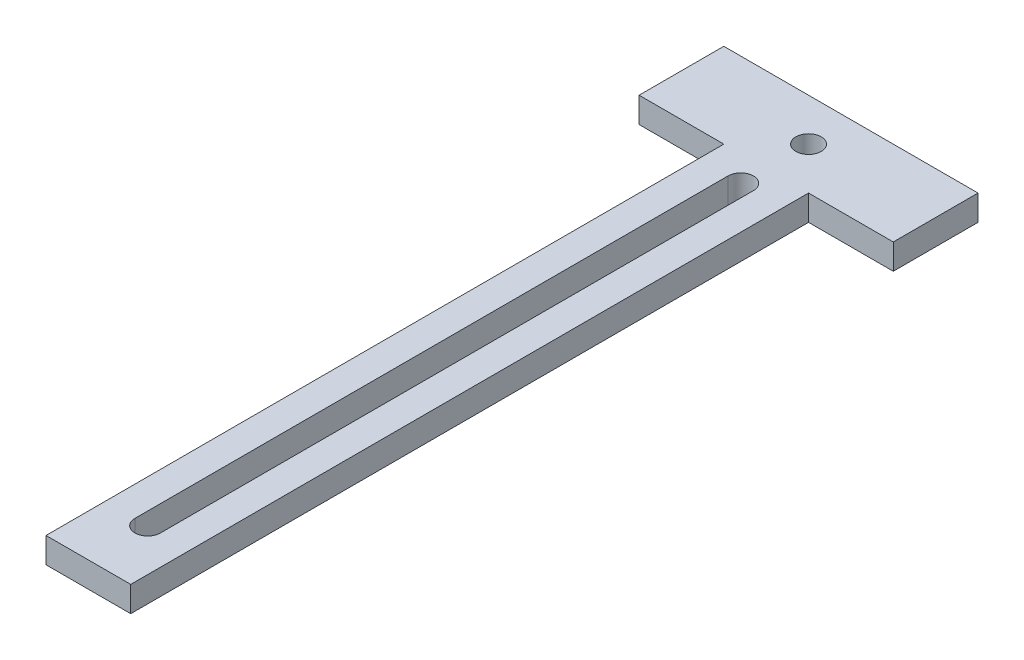
ISO-10303-21;
HEADER;
FILE_DESCRIPTION(('STEP AP214'),'2;1');
FILE_NAME('part.step','',(''),(''),'','','');
FILE_SCHEMA(('AUTOMOTIVE_DESIGN { 1 0 10303 214 1 1 1 1 }'));
ENDSEC;
DATA;
#1=APPLICATION_CONTEXT('core data for automotive mechanical design processes');
#2=APPLICATION_PROTOCOL_DEFINITION('international standard','automotive_design',2000,#1);
#3=PRODUCT_CONTEXT('',#1,'mechanical');
#4=PRODUCT('Part','Part','',(#3));
#5=PRODUCT_RELATED_PRODUCT_CATEGORY('part','',(#4));
#6=PRODUCT_DEFINITION_FORMATION('','',#4);
#7=PRODUCT_DEFINITION_CONTEXT('part definition',#1,'design');
#8=PRODUCT_DEFINITION('design','',#6,#7);
#9=PRODUCT_DEFINITION_SHAPE('','',#8);
#10=(LENGTH_UNIT() NAMED_UNIT(*) SI_UNIT(.MILLI.,.METRE.));
#11=(NAMED_UNIT(*) PLANE_ANGLE_UNIT() SI_UNIT($,.RADIAN.));
#12=(NAMED_UNIT(*) SI_UNIT($,.STERADIAN.) SOLID_ANGLE_UNIT());
#13=UNCERTAINTY_MEASURE_WITH_UNIT(LENGTH_MEASURE(1.E-05),#10,'distance_accuracy_value','');
#14=(GEOMETRIC_REPRESENTATION_CONTEXT(3) GLOBAL_UNCERTAINTY_ASSIGNED_CONTEXT((#13)) GLOBAL_UNIT_ASSIGNED_CONTEXT((#10,
#11,#12)) REPRESENTATION_CONTEXT('',''));
#15=CARTESIAN_POINT('',(0.,0.,0.));
#16=DIRECTION('',(0.,0.,1.));
#17=DIRECTION('',(1.,0.,0.));
#18=AXIS2_PLACEMENT_3D('',#15,#16,#17);
#19=CARTESIAN_POINT('',(-15.,3.,5.));
#20=DIRECTION('',(0.,0.,-1.));
#21=DIRECTION('',(-1.,0.,0.));
#22=AXIS2_PLACEMENT_3D('',#19,#20,#21);
#23=PLANE('',#22);
#24=DIRECTION('',(0.,-1.,0.));
#25=VECTOR('',#24,1.);
#26=CARTESIAN_POINT('',(-5.,3.,5.));
#27=LINE('',#26,#25);
#28=CARTESIAN_POINT('',(-5.,3.,5.));
#29=VERTEX_POINT('',#28);
#30=CARTESIAN_POINT('',(-5.,0.,5.));
#31=VERTEX_POINT('',#30);
#32=EDGE_CURVE('E190',#29,#31,#27,.T.);
#33=ORIENTED_EDGE('',*,*,#32,.F.);
#34=DIRECTION('',(1.,0.,0.));
#35=VECTOR('',#34,1.);
#36=CARTESIAN_POINT('',(-15.,3.,5.));
#37=LINE('',#36,#35);
#38=CARTESIAN_POINT('',(-15.,3.,5.));
#39=VERTEX_POINT('',#38);
#40=EDGE_CURVE('E207',#39,#29,#37,.T.);
#41=ORIENTED_EDGE('',*,*,#40,.F.);
#42=DIRECTION('',(0.,-1.,0.));
#43=VECTOR('',#42,1.);
#44=CARTESIAN_POINT('',(-15.,3.,5.));
#45=LINE('',#44,#43);
#46=CARTESIAN_POINT('',(-15.,0.,5.));
#47=VERTEX_POINT('',#46);
#48=EDGE_CURVE('E220',#39,#47,#45,.T.);
#49=ORIENTED_EDGE('',*,*,#48,.T.);
#50=DIRECTION('',(1.,0.,0.));
#51=VECTOR('',#50,1.);
#52=CARTESIAN_POINT('',(-15.,0.,5.));
#53=LINE('',#52,#51);
#54=EDGE_CURVE('E203',#47,#31,#53,.T.);
#55=ORIENTED_EDGE('',*,*,#54,.T.);
#56=EDGE_LOOP('',(#33,#41,#49,#55));
#57=FACE_BOUND('',#56,.T.);
#58=ADVANCED_FACE('F33',(#57),#23,.F.);
#59=CARTESIAN_POINT('',(0.,3.,0.));
#60=DIRECTION('',(0.,1.,0.));
#61=DIRECTION('',(0.,0.,1.));
#62=AXIS2_PLACEMENT_3D('',#59,#60,#61);
#63=PLANE('',#62);
#64=DIRECTION('',(0.,0.,-1.));
#65=VECTOR('',#64,1.);
#66=CARTESIAN_POINT('',(15.,3.,-5.));
#67=LINE('',#66,#65);
#68=CARTESIAN_POINT('',(15.,3.,5.));
#69=VERTEX_POINT('',#68);
#70=CARTESIAN_POINT('',(15.,3.,-5.));
#71=VERTEX_POINT('',#70);
#72=EDGE_CURVE('E201',#69,#71,#67,.T.);
#73=ORIENTED_EDGE('',*,*,#72,.T.);
#74=DIRECTION('',(-1.,0.,0.));
#75=VECTOR('',#74,1.);
#76=CARTESIAN_POINT('',(-15.,3.,-5.));
#77=LINE('',#76,#75);
#78=CARTESIAN_POINT('',(-15.,3.,-5.));
#79=VERTEX_POINT('',#78);
#80=EDGE_CURVE('E85',#71,#79,#77,.T.);
#81=ORIENTED_EDGE('',*,*,#80,.T.);
#82=DIRECTION('',(0.,0.,1.));
#83=VECTOR('',#82,1.);
#84=CARTESIAN_POINT('',(-15.,3.,-5.));
#85=LINE('',#84,#83);
#86=EDGE_CURVE('E205',#79,#39,#85,.T.);
#87=ORIENTED_EDGE('',*,*,#86,.T.);
#88=ORIENTED_EDGE('',*,*,#40,.T.);
#89=DIRECTION('',(0.,0.,1.));
#90=VECTOR('',#89,1.);
#91=CARTESIAN_POINT('',(-5.,3.,5.));
#92=LINE('',#91,#90);
#93=CARTESIAN_POINT('',(-5.,3.,85.));
#94=VERTEX_POINT('',#93);
#95=EDGE_CURVE('E176',#29,#94,#92,.T.);
#96=ORIENTED_EDGE('',*,*,#95,.T.);
#97=DIRECTION('',(1.,0.,0.));
#98=VECTOR('',#97,1.);
#99=CARTESIAN_POINT('',(5.,3.,85.));
#100=LINE('',#99,#98);
#101=CARTESIAN_POINT('',(5.,3.,85.));
#102=VERTEX_POINT('',#101);
#103=EDGE_CURVE('E179',#94,#102,#100,.T.);
#104=ORIENTED_EDGE('',*,*,#103,.T.);
#105=DIRECTION('',(0.,0.,-1.));
#106=VECTOR('',#105,1.);
#107=CARTESIAN_POINT('',(5.,3.,5.));
#108=LINE('',#107,#106);
#109=CARTESIAN_POINT('',(5.,3.,5.));
#110=VERTEX_POINT('',#109);
#111=EDGE_CURVE('E174',#102,#110,#108,.T.);
#112=ORIENTED_EDGE('',*,*,#111,.T.);
#113=EDGE_CURVE('E57',#110,#69,#37,.T.);
#114=ORIENTED_EDGE('',*,*,#113,.T.);
#115=EDGE_LOOP('',(#73,#81,#87,#88,#96,#104,#112,#114));
#116=FACE_BOUND('',#115,.T.);
#117=CARTESIAN_POINT('',(0.,3.,0.));
#118=DIRECTION('',(0.,1.,0.));
#119=DIRECTION('',(0.,0.,1.));
#120=AXIS2_PLACEMENT_3D('',#117,#118,#119);
#121=CIRCLE('',#120,1.5);
#122=CARTESIAN_POINT('',(0.,3.,1.5));
#123=VERTEX_POINT('',#122);
#124=EDGE_CURVE('E195',#123,#123,#121,.T.);
#125=ORIENTED_EDGE('',*,*,#124,.F.);
#126=EDGE_LOOP('',(#125));
#127=FACE_BOUND('',#126,.T.);
#128=CARTESIAN_POINT('',(0.,3.,8.));
#129=DIRECTION('',(0.,1.,0.));
#130=DIRECTION('',(0.,0.,1.));
#131=AXIS2_PLACEMENT_3D('',#128,#129,#130);
#132=CIRCLE('',#131,1.5);
#133=CARTESIAN_POINT('',(1.5,3.,8.));
#134=VERTEX_POINT('',#133);
#135=CARTESIAN_POINT('',(-1.5,3.,8.));
#136=VERTEX_POINT('',#135);
#137=EDGE_CURVE('E133',#134,#136,#132,.T.);
#138=ORIENTED_EDGE('',*,*,#137,.F.);
#139=DIRECTION('',(0.,0.,-1.));
#140=VECTOR('',#139,1.);
#141=CARTESIAN_POINT('',(1.5,3.,8.));
#142=LINE('',#141,#140);
#143=CARTESIAN_POINT('',(1.5,3.,78.));
#144=VERTEX_POINT('',#143);
#145=EDGE_CURVE('E158',#144,#134,#142,.T.);
#146=ORIENTED_EDGE('',*,*,#145,.F.);
#147=CARTESIAN_POINT('',(0.,3.,78.));
#148=DIRECTION('',(0.,1.,0.));
#149=DIRECTION('',(0.,0.,1.));
#150=AXIS2_PLACEMENT_3D('',#147,#148,#149);
#151=CIRCLE('',#150,1.5);
#152=CARTESIAN_POINT('',(-1.5,3.,78.));
#153=VERTEX_POINT('',#152);
#154=EDGE_CURVE('E156',#153,#144,#151,.T.);
#155=ORIENTED_EDGE('',*,*,#154,.F.);
#156=DIRECTION('',(0.,0.,1.));
#157=VECTOR('',#156,1.);
#158=CARTESIAN_POINT('',(-1.5,3.,8.));
#159=LINE('',#158,#157);
#160=EDGE_CURVE('E143',#136,#153,#159,.T.);
#161=ORIENTED_EDGE('',*,*,#160,.F.);
#162=EDGE_LOOP('',(#138,#146,#155,#161));
#163=FACE_BOUND('',#162,.T.);
#164=ADVANCED_FACE('F154',(#116,#127,#163),#63,.T.);
#165=CARTESIAN_POINT('',(0.,0.,0.));
#166=DIRECTION('',(0.,1.,0.));
#167=DIRECTION('',(0.,0.,1.));
#168=AXIS2_PLACEMENT_3D('',#165,#166,#167);
#169=PLANE('',#168);
#170=DIRECTION('',(0.,0.,-1.));
#171=VECTOR('',#170,1.);
#172=CARTESIAN_POINT('',(15.,0.,-5.));
#173=LINE('',#172,#171);
#174=CARTESIAN_POINT('',(15.,0.,5.));
#175=VERTEX_POINT('',#174);
#176=CARTESIAN_POINT('',(15.,0.,-5.));
#177=VERTEX_POINT('',#176);
#178=EDGE_CURVE('E198',#175,#177,#173,.T.);
#179=ORIENTED_EDGE('',*,*,#178,.F.);
#180=CARTESIAN_POINT('',(5.,0.,5.));
#181=VERTEX_POINT('',#180);
#182=EDGE_CURVE('E78',#181,#175,#53,.T.);
#183=ORIENTED_EDGE('',*,*,#182,.F.);
#184=DIRECTION('',(0.,0.,-1.));
#185=VECTOR('',#184,1.);
#186=CARTESIAN_POINT('',(5.,0.,5.));
#187=LINE('',#186,#185);
#188=CARTESIAN_POINT('',(5.,0.,85.));
#189=VERTEX_POINT('',#188);
#190=EDGE_CURVE('E48',#189,#181,#187,.T.);
#191=ORIENTED_EDGE('',*,*,#190,.F.);
#192=DIRECTION('',(1.,0.,0.));
#193=VECTOR('',#192,1.);
#194=CARTESIAN_POINT('',(5.,0.,85.));
#195=LINE('',#194,#193);
#196=CARTESIAN_POINT('',(-5.,0.,85.));
#197=VERTEX_POINT('',#196);
#198=EDGE_CURVE('E177',#197,#189,#195,.T.);
#199=ORIENTED_EDGE('',*,*,#198,.F.);
#200=DIRECTION('',(0.,0.,1.));
#201=VECTOR('',#200,1.);
#202=CARTESIAN_POINT('',(-5.,0.,5.));
#203=LINE('',#202,#201);
#204=EDGE_CURVE('E183',#31,#197,#203,.T.);
#205=ORIENTED_EDGE('',*,*,#204,.F.);
#206=ORIENTED_EDGE('',*,*,#54,.F.);
#207=DIRECTION('',(0.,0.,1.));
#208=VECTOR('',#207,1.);
#209=CARTESIAN_POINT('',(-15.,0.,-5.));
#210=LINE('',#209,#208);
#211=CARTESIAN_POINT('',(-15.,0.,-5.));
#212=VERTEX_POINT('',#211);
#213=EDGE_CURVE('E215',#212,#47,#210,.T.);
#214=ORIENTED_EDGE('',*,*,#213,.F.);
#215=DIRECTION('',(-1.,0.,0.));
#216=VECTOR('',#215,1.);
#217=CARTESIAN_POINT('',(-15.,0.,-5.));
#218=LINE('',#217,#216);
#219=EDGE_CURVE('E213',#177,#212,#218,.T.);
#220=ORIENTED_EDGE('',*,*,#219,.F.);
#221=EDGE_LOOP('',(#179,#183,#191,#199,#205,#206,#214,#220));
#222=FACE_BOUND('',#221,.T.);
#223=CARTESIAN_POINT('',(0.,0.,0.));
#224=DIRECTION('',(0.,1.,0.));
#225=DIRECTION('',(0.,0.,1.));
#226=AXIS2_PLACEMENT_3D('',#223,#224,#225);
#227=CIRCLE('',#226,1.5);
#228=CARTESIAN_POINT('',(0.,0.,1.5));
#229=VERTEX_POINT('',#228);
#230=EDGE_CURVE('E194',#229,#229,#227,.T.);
#231=ORIENTED_EDGE('',*,*,#230,.T.);
#232=EDGE_LOOP('',(#231));
#233=FACE_BOUND('',#232,.T.);
#234=DIRECTION('',(0.,0.,-1.));
#235=VECTOR('',#234,1.);
#236=CARTESIAN_POINT('',(1.5,0.,8.));
#237=LINE('',#236,#235);
#238=CARTESIAN_POINT('',(1.5,0.,78.));
#239=VERTEX_POINT('',#238);
#240=CARTESIAN_POINT('',(1.5,0.,8.));
#241=VERTEX_POINT('',#240);
#242=EDGE_CURVE('E144',#239,#241,#237,.T.);
#243=ORIENTED_EDGE('',*,*,#242,.T.);
#244=CARTESIAN_POINT('',(0.,0.,8.));
#245=DIRECTION('',(0.,1.,0.));
#246=DIRECTION('',(0.,0.,1.));
#247=AXIS2_PLACEMENT_3D('',#244,#245,#246);
#248=CIRCLE('',#247,1.5);
#249=CARTESIAN_POINT('',(-1.5,0.,8.));
#250=VERTEX_POINT('',#249);
#251=EDGE_CURVE('E162',#241,#250,#248,.T.);
#252=ORIENTED_EDGE('',*,*,#251,.T.);
#253=DIRECTION('',(0.,0.,1.));
#254=VECTOR('',#253,1.);
#255=CARTESIAN_POINT('',(-1.5,0.,8.));
#256=LINE('',#255,#254);
#257=CARTESIAN_POINT('',(-1.5,0.,78.));
#258=VERTEX_POINT('',#257);
#259=EDGE_CURVE('E150',#250,#258,#256,.T.);
#260=ORIENTED_EDGE('',*,*,#259,.T.);
#261=CARTESIAN_POINT('',(0.,0.,78.));
#262=DIRECTION('',(0.,1.,0.));
#263=DIRECTION('',(0.,0.,1.));
#264=AXIS2_PLACEMENT_3D('',#261,#262,#263);
#265=CIRCLE('',#264,1.5);
#266=EDGE_CURVE('E165',#258,#239,#265,.T.);
#267=ORIENTED_EDGE('',*,*,#266,.T.);
#268=EDGE_LOOP('',(#243,#252,#260,#267));
#269=FACE_BOUND('',#268,.T.);
#270=ADVANCED_FACE('F231',(#222,#233,#269),#169,.F.);
#271=CARTESIAN_POINT('',(15.,3.,-5.));
#272=DIRECTION('',(-1.,0.,0.));
#273=DIRECTION('',(0.,0.,1.));
#274=AXIS2_PLACEMENT_3D('',#271,#272,#273);
#275=PLANE('',#274);
#276=ORIENTED_EDGE('',*,*,#178,.T.);
#277=DIRECTION('',(0.,-1.,0.));
#278=VECTOR('',#277,1.);
#279=CARTESIAN_POINT('',(15.,3.,-5.));
#280=LINE('',#279,#278);
#281=EDGE_CURVE('E11',#71,#177,#280,.T.);
#282=ORIENTED_EDGE('',*,*,#281,.F.);
#283=ORIENTED_EDGE('',*,*,#72,.F.);
#284=DIRECTION('',(0.,-1.,0.));
#285=VECTOR('',#284,1.);
#286=CARTESIAN_POINT('',(15.,3.,5.));
#287=LINE('',#286,#285);
#288=EDGE_CURVE('E210',#69,#175,#287,.T.);
#289=ORIENTED_EDGE('',*,*,#288,.T.);
#290=EDGE_LOOP('',(#276,#282,#283,#289));
#291=FACE_BOUND('',#290,.T.);
#292=ADVANCED_FACE('F35',(#291),#275,.F.);
#293=CARTESIAN_POINT('',(-15.,3.,-5.));
#294=DIRECTION('',(0.,0.,1.));
#295=DIRECTION('',(1.,0.,0.));
#296=AXIS2_PLACEMENT_3D('',#293,#294,#295);
#297=PLANE('',#296);
#298=ORIENTED_EDGE('',*,*,#219,.T.);
#299=DIRECTION('',(0.,-1.,0.));
#300=VECTOR('',#299,1.);
#301=CARTESIAN_POINT('',(-15.,3.,-5.));
#302=LINE('',#301,#300);
#303=EDGE_CURVE('E41',#79,#212,#302,.T.);
#304=ORIENTED_EDGE('',*,*,#303,.F.);
#305=ORIENTED_EDGE('',*,*,#80,.F.);
#306=ORIENTED_EDGE('',*,*,#281,.T.);
#307=EDGE_LOOP('',(#298,#304,#305,#306));
#308=FACE_BOUND('',#307,.T.);
#309=ADVANCED_FACE('F243',(#308),#297,.F.);
#310=CARTESIAN_POINT('',(-15.,3.,-5.));
#311=DIRECTION('',(1.,0.,0.));
#312=DIRECTION('',(0.,0.,-1.));
#313=AXIS2_PLACEMENT_3D('',#310,#311,#312);
#314=PLANE('',#313);
#315=ORIENTED_EDGE('',*,*,#213,.T.);
#316=ORIENTED_EDGE('',*,*,#48,.F.);
#317=ORIENTED_EDGE('',*,*,#86,.F.);
#318=ORIENTED_EDGE('',*,*,#303,.T.);
#319=EDGE_LOOP('',(#315,#316,#317,#318));
#320=FACE_BOUND('',#319,.T.);
#321=ADVANCED_FACE('F226',(#320),#314,.F.);
#322=ORIENTED_EDGE('',*,*,#113,.F.);
#323=DIRECTION('',(0.,-1.,0.));
#324=VECTOR('',#323,1.);
#325=CARTESIAN_POINT('',(5.,3.,5.));
#326=LINE('',#325,#324);
#327=EDGE_CURVE('E192',#110,#181,#326,.T.);
#328=ORIENTED_EDGE('',*,*,#327,.T.);
#329=ORIENTED_EDGE('',*,*,#182,.T.);
#330=ORIENTED_EDGE('',*,*,#288,.F.);
#331=EDGE_LOOP('',(#322,#328,#329,#330));
#332=FACE_BOUND('',#331,.T.);
#333=ADVANCED_FACE('F249',(#332),#23,.F.);
#334=CARTESIAN_POINT('',(0.,3.,0.));
#335=DIRECTION('',(0.,-1.,0.));
#336=DIRECTION('',(0.,0.,-1.));
#337=AXIS2_PLACEMENT_3D('',#334,#335,#336);
#338=CYLINDRICAL_SURFACE('',#337,1.5);
#339=ORIENTED_EDGE('',*,*,#124,.T.);
#340=EDGE_LOOP('',(#339));
#341=FACE_BOUND('',#340,.T.);
#342=ORIENTED_EDGE('',*,*,#230,.F.);
#343=EDGE_LOOP('',(#342));
#344=FACE_BOUND('',#343,.T.);
#345=ADVANCED_FACE('F259',(#341,#344),#338,.F.);
#346=CARTESIAN_POINT('',(5.,3.,5.));
#347=DIRECTION('',(-1.,0.,0.));
#348=DIRECTION('',(0.,0.,1.));
#349=AXIS2_PLACEMENT_3D('',#346,#347,#348);
#350=PLANE('',#349);
#351=ORIENTED_EDGE('',*,*,#190,.T.);
#352=ORIENTED_EDGE('',*,*,#327,.F.);
#353=ORIENTED_EDGE('',*,*,#111,.F.);
#354=DIRECTION('',(0.,-1.,0.));
#355=VECTOR('',#354,1.);
#356=CARTESIAN_POINT('',(5.,3.,85.));
#357=LINE('',#356,#355);
#358=EDGE_CURVE('E181',#102,#189,#357,.T.);
#359=ORIENTED_EDGE('',*,*,#358,.T.);
#360=EDGE_LOOP('',(#351,#352,#353,#359));
#361=FACE_BOUND('',#360,.T.);
#362=ADVANCED_FACE('F263',(#361),#350,.F.);
#363=CARTESIAN_POINT('',(-5.,3.,5.));
#364=DIRECTION('',(1.,0.,0.));
#365=DIRECTION('',(0.,0.,-1.));
#366=AXIS2_PLACEMENT_3D('',#363,#364,#365);
#367=PLANE('',#366);
#368=ORIENTED_EDGE('',*,*,#204,.T.);
#369=DIRECTION('',(0.,-1.,0.));
#370=VECTOR('',#369,1.);
#371=CARTESIAN_POINT('',(-5.,3.,85.));
#372=LINE('',#371,#370);
#373=EDGE_CURVE('E187',#94,#197,#372,.T.);
#374=ORIENTED_EDGE('',*,*,#373,.F.);
#375=ORIENTED_EDGE('',*,*,#95,.F.);
#376=ORIENTED_EDGE('',*,*,#32,.T.);
#377=EDGE_LOOP('',(#368,#374,#375,#376));
#378=FACE_BOUND('',#377,.T.);
#379=ADVANCED_FACE('F272',(#378),#367,.F.);
#380=CARTESIAN_POINT('',(5.,3.,85.));
#381=DIRECTION('',(0.,0.,-1.));
#382=DIRECTION('',(-1.,0.,0.));
#383=AXIS2_PLACEMENT_3D('',#380,#381,#382);
#384=PLANE('',#383);
#385=ORIENTED_EDGE('',*,*,#198,.T.);
#386=ORIENTED_EDGE('',*,*,#358,.F.);
#387=ORIENTED_EDGE('',*,*,#103,.F.);
#388=ORIENTED_EDGE('',*,*,#373,.T.);
#389=EDGE_LOOP('',(#385,#386,#387,#388));
#390=FACE_BOUND('',#389,.T.);
#391=ADVANCED_FACE('F268',(#390),#384,.F.);
#392=CARTESIAN_POINT('',(0.,3.,8.));
#393=DIRECTION('',(0.,-1.,0.));
#394=DIRECTION('',(0.,0.,-1.));
#395=AXIS2_PLACEMENT_3D('',#392,#393,#394);
#396=CYLINDRICAL_SURFACE('',#395,1.5);
#397=ORIENTED_EDGE('',*,*,#251,.F.);
#398=DIRECTION('',(0.,-1.,0.));
#399=VECTOR('',#398,1.);
#400=CARTESIAN_POINT('',(1.5,3.,8.));
#401=LINE('',#400,#399);
#402=EDGE_CURVE('E139',#134,#241,#401,.T.);
#403=ORIENTED_EDGE('',*,*,#402,.F.);
#404=ORIENTED_EDGE('',*,*,#137,.T.);
#405=DIRECTION('',(0.,-1.,0.));
#406=VECTOR('',#405,1.);
#407=CARTESIAN_POINT('',(-1.5,3.,8.));
#408=LINE('',#407,#406);
#409=EDGE_CURVE('E136',#136,#250,#408,.T.);
#410=ORIENTED_EDGE('',*,*,#409,.T.);
#411=EDGE_LOOP('',(#397,#403,#404,#410));
#412=FACE_BOUND('',#411,.T.);
#413=ADVANCED_FACE('F135',(#412),#396,.F.);
#414=CARTESIAN_POINT('',(-1.5,3.,8.));
#415=DIRECTION('',(1.,0.,0.));
#416=DIRECTION('',(0.,0.,-1.));
#417=AXIS2_PLACEMENT_3D('',#414,#415,#416);
#418=PLANE('',#417);
#419=ORIENTED_EDGE('',*,*,#259,.F.);
#420=ORIENTED_EDGE('',*,*,#409,.F.);
#421=ORIENTED_EDGE('',*,*,#160,.T.);
#422=DIRECTION('',(0.,-1.,0.));
#423=VECTOR('',#422,1.);
#424=CARTESIAN_POINT('',(-1.5,3.,78.));
#425=LINE('',#424,#423);
#426=EDGE_CURVE('E151',#153,#258,#425,.T.);
#427=ORIENTED_EDGE('',*,*,#426,.T.);
#428=EDGE_LOOP('',(#419,#420,#421,#427));
#429=FACE_BOUND('',#428,.T.);
#430=ADVANCED_FACE('F147',(#429),#418,.T.);
#431=CARTESIAN_POINT('',(0.,3.,78.));
#432=DIRECTION('',(0.,-1.,0.));
#433=DIRECTION('',(0.,0.,-1.));
#434=AXIS2_PLACEMENT_3D('',#431,#432,#433);
#435=CYLINDRICAL_SURFACE('',#434,1.5);
#436=ORIENTED_EDGE('',*,*,#266,.F.);
#437=ORIENTED_EDGE('',*,*,#426,.F.);
#438=ORIENTED_EDGE('',*,*,#154,.T.);
#439=DIRECTION('',(0.,-1.,0.));
#440=VECTOR('',#439,1.);
#441=CARTESIAN_POINT('',(1.5,3.,78.));
#442=LINE('',#441,#440);
#443=EDGE_CURVE('E171',#144,#239,#442,.T.);
#444=ORIENTED_EDGE('',*,*,#443,.T.);
#445=EDGE_LOOP('',(#436,#437,#438,#444));
#446=FACE_BOUND('',#445,.T.);
#447=ADVANCED_FACE('F354',(#446),#435,.F.);
#448=CARTESIAN_POINT('',(1.5,3.,8.));
#449=DIRECTION('',(-1.,0.,0.));
#450=DIRECTION('',(0.,0.,1.));
#451=AXIS2_PLACEMENT_3D('',#448,#449,#450);
#452=PLANE('',#451);
#453=ORIENTED_EDGE('',*,*,#242,.F.);
#454=ORIENTED_EDGE('',*,*,#443,.F.);
#455=ORIENTED_EDGE('',*,*,#145,.T.);
#456=ORIENTED_EDGE('',*,*,#402,.T.);
#457=EDGE_LOOP('',(#453,#454,#455,#456));
#458=FACE_BOUND('',#457,.T.);
#459=ADVANCED_FACE('F362',(#458),#452,.T.);
#460=CLOSED_SHELL('',(#58,#164,#270,#292,#309,#321,#333,#345,#362,#379,#391,#413,#430,#447,#459));
#461=MANIFOLD_SOLID_BREP('B2',#460);
#462=ADVANCED_BREP_SHAPE_REPRESENTATION('',(#18,#461),#14);
#463=SHAPE_DEFINITION_REPRESENTATION(#9,#462);
ENDSEC;
END-ISO-10303-21;
